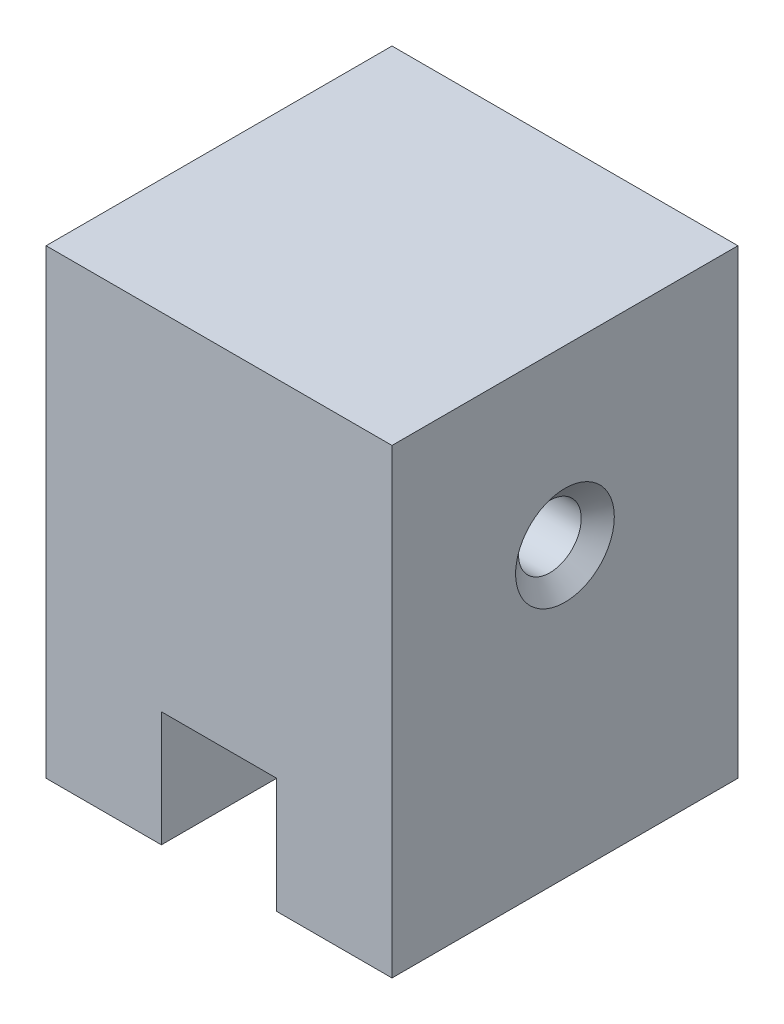
ISO-10303-21;
HEADER;
FILE_DESCRIPTION(('STEP AP214'),'2;1');
FILE_NAME('part.step','',(''),(''),'','','');
FILE_SCHEMA(('AUTOMOTIVE_DESIGN { 1 0 10303 214 1 1 1 1 }'));
ENDSEC;
DATA;
#1=APPLICATION_CONTEXT('core data for automotive mechanical design processes');
#2=APPLICATION_PROTOCOL_DEFINITION('international standard','automotive_design',2000,#1);
#3=PRODUCT_CONTEXT('',#1,'mechanical');
#4=PRODUCT('Part','Part','',(#3));
#5=PRODUCT_RELATED_PRODUCT_CATEGORY('part','',(#4));
#6=PRODUCT_DEFINITION_FORMATION('','',#4);
#7=PRODUCT_DEFINITION_CONTEXT('part definition',#1,'design');
#8=PRODUCT_DEFINITION('design','',#6,#7);
#9=PRODUCT_DEFINITION_SHAPE('','',#8);
#10=(LENGTH_UNIT() NAMED_UNIT(*) SI_UNIT(.MILLI.,.METRE.));
#11=(NAMED_UNIT(*) PLANE_ANGLE_UNIT() SI_UNIT($,.RADIAN.));
#12=(NAMED_UNIT(*) SI_UNIT($,.STERADIAN.) SOLID_ANGLE_UNIT());
#13=UNCERTAINTY_MEASURE_WITH_UNIT(LENGTH_MEASURE(1.E-05),#10,'distance_accuracy_value','');
#14=(GEOMETRIC_REPRESENTATION_CONTEXT(3) GLOBAL_UNCERTAINTY_ASSIGNED_CONTEXT((#13)) GLOBAL_UNIT_ASSIGNED_CONTEXT((#10,
#11,#12)) REPRESENTATION_CONTEXT('',''));
#15=CARTESIAN_POINT('',(0.,0.,0.));
#16=DIRECTION('',(0.,0.,1.));
#17=DIRECTION('',(1.,0.,0.));
#18=AXIS2_PLACEMENT_3D('',#15,#16,#17);
#19=CARTESIAN_POINT('',(0.,0.,0.));
#20=DIRECTION('',(0.,-1.,0.));
#21=DIRECTION('',(0.,0.,-1.));
#22=AXIS2_PLACEMENT_3D('',#19,#20,#21);
#23=PLANE('',#22);
#24=DIRECTION('',(0.,0.,1.));
#25=VECTOR('',#24,1.);
#26=CARTESIAN_POINT('',(-3.175,0.,-9.525));
#27=LINE('',#26,#25);
#28=CARTESIAN_POINT('',(-3.175,0.,-9.525));
#29=VERTEX_POINT('',#28);
#30=CARTESIAN_POINT('',(-3.175,0.,9.525));
#31=VERTEX_POINT('',#30);
#32=EDGE_CURVE('E121',#29,#31,#27,.T.);
#33=ORIENTED_EDGE('',*,*,#32,.T.);
#34=DIRECTION('',(1.,0.,0.));
#35=VECTOR('',#34,1.);
#36=CARTESIAN_POINT('',(-9.525,0.,9.525));
#37=LINE('',#36,#35);
#38=CARTESIAN_POINT('',(-9.525,0.,9.525));
#39=VERTEX_POINT('',#38);
#40=EDGE_CURVE('E153',#39,#31,#37,.T.);
#41=ORIENTED_EDGE('',*,*,#40,.F.);
#42=DIRECTION('',(0.,0.,1.));
#43=VECTOR('',#42,1.);
#44=CARTESIAN_POINT('',(-9.525,0.,9.525));
#45=LINE('',#44,#43);
#46=CARTESIAN_POINT('',(-9.525,0.,-9.525));
#47=VERTEX_POINT('',#46);
#48=EDGE_CURVE('E142',#47,#39,#45,.T.);
#49=ORIENTED_EDGE('',*,*,#48,.F.);
#50=DIRECTION('',(-1.,0.,0.));
#51=VECTOR('',#50,1.);
#52=CARTESIAN_POINT('',(-9.525,0.,-9.525));
#53=LINE('',#52,#51);
#54=EDGE_CURVE('E136',#29,#47,#53,.T.);
#55=ORIENTED_EDGE('',*,*,#54,.F.);
#56=EDGE_LOOP('',(#33,#41,#49,#55));
#57=FACE_BOUND('',#56,.T.);
#58=ADVANCED_FACE('F47',(#57),#23,.T.);
#59=CARTESIAN_POINT('',(9.525,25.4,9.525));
#60=DIRECTION('',(-1.,0.,0.));
#61=DIRECTION('',(0.,0.,1.));
#62=AXIS2_PLACEMENT_3D('',#59,#60,#61);
#63=PLANE('',#62);
#64=CARTESIAN_POINT('',(9.525,15.875,0.));
#65=DIRECTION('',(1.,0.,0.));
#66=DIRECTION('',(0.,0.,-1.));
#67=AXIS2_PLACEMENT_3D('',#64,#65,#66);
#68=CIRCLE('',#67,2.7178);
#69=CARTESIAN_POINT('',(9.525,15.875,-2.7178));
#70=VERTEX_POINT('',#69);
#71=EDGE_CURVE('E187',#70,#70,#68,.T.);
#72=ORIENTED_EDGE('',*,*,#71,.F.);
#73=EDGE_LOOP('',(#72));
#74=FACE_BOUND('',#73,.T.);
#75=DIRECTION('',(0.,0.,-1.));
#76=VECTOR('',#75,1.);
#77=CARTESIAN_POINT('',(9.525,0.,9.525));
#78=LINE('',#77,#76);
#79=CARTESIAN_POINT('',(9.525,0.,9.525));
#80=VERTEX_POINT('',#79);
#81=CARTESIAN_POINT('',(9.525,0.,-9.525));
#82=VERTEX_POINT('',#81);
#83=EDGE_CURVE('E144',#80,#82,#78,.T.);
#84=ORIENTED_EDGE('',*,*,#83,.T.);
#85=DIRECTION('',(0.,-1.,0.));
#86=VECTOR('',#85,1.);
#87=CARTESIAN_POINT('',(9.525,25.4,-9.525));
#88=LINE('',#87,#86);
#89=CARTESIAN_POINT('',(9.525,25.4,-9.525));
#90=VERTEX_POINT('',#89);
#91=EDGE_CURVE('E13',#90,#82,#88,.T.);
#92=ORIENTED_EDGE('',*,*,#91,.F.);
#93=DIRECTION('',(0.,0.,-1.));
#94=VECTOR('',#93,1.);
#95=CARTESIAN_POINT('',(9.525,25.4,9.525));
#96=LINE('',#95,#94);
#97=CARTESIAN_POINT('',(9.525,25.4,9.525));
#98=VERTEX_POINT('',#97);
#99=EDGE_CURVE('E155',#98,#90,#96,.T.);
#100=ORIENTED_EDGE('',*,*,#99,.F.);
#101=DIRECTION('',(0.,-1.,0.));
#102=VECTOR('',#101,1.);
#103=CARTESIAN_POINT('',(9.525,25.4,9.525));
#104=LINE('',#103,#102);
#105=EDGE_CURVE('E156',#98,#80,#104,.T.);
#106=ORIENTED_EDGE('',*,*,#105,.T.);
#107=EDGE_LOOP('',(#84,#92,#100,#106));
#108=FACE_BOUND('',#107,.T.);
#109=ADVANCED_FACE('F49',(#74,#108),#63,.F.);
#110=CARTESIAN_POINT('',(-9.525,25.4,-9.525));
#111=DIRECTION('',(0.,0.,1.));
#112=DIRECTION('',(1.,0.,0.));
#113=AXIS2_PLACEMENT_3D('',#110,#111,#112);
#114=PLANE('',#113);
#115=DIRECTION('',(-1.,0.,0.));
#116=VECTOR('',#115,1.);
#117=CARTESIAN_POINT('',(-3.175,6.35,-9.525));
#118=LINE('',#117,#116);
#119=CARTESIAN_POINT('',(3.175,6.35,-9.525));
#120=VERTEX_POINT('',#119);
#121=CARTESIAN_POINT('',(-3.175,6.35,-9.525));
#122=VERTEX_POINT('',#121);
#123=EDGE_CURVE('E133',#120,#122,#118,.T.);
#124=ORIENTED_EDGE('',*,*,#123,.T.);
#125=DIRECTION('',(0.,-1.,0.));
#126=VECTOR('',#125,1.);
#127=CARTESIAN_POINT('',(-3.175,0.,-9.525));
#128=LINE('',#127,#126);
#129=EDGE_CURVE('E124',#122,#29,#128,.T.);
#130=ORIENTED_EDGE('',*,*,#129,.T.);
#131=ORIENTED_EDGE('',*,*,#54,.T.);
#132=DIRECTION('',(0.,-1.,0.));
#133=VECTOR('',#132,1.);
#134=CARTESIAN_POINT('',(-9.525,25.4,-9.525));
#135=LINE('',#134,#133);
#136=CARTESIAN_POINT('',(-9.525,25.4,-9.525));
#137=VERTEX_POINT('',#136);
#138=EDGE_CURVE('E55',#137,#47,#135,.T.);
#139=ORIENTED_EDGE('',*,*,#138,.F.);
#140=DIRECTION('',(-1.,0.,0.));
#141=VECTOR('',#140,1.);
#142=CARTESIAN_POINT('',(-9.525,25.4,-9.525));
#143=LINE('',#142,#141);
#144=EDGE_CURVE('E99',#90,#137,#143,.T.);
#145=ORIENTED_EDGE('',*,*,#144,.F.);
#146=ORIENTED_EDGE('',*,*,#91,.T.);
#147=CARTESIAN_POINT('',(3.175,0.,-9.525));
#148=VERTEX_POINT('',#147);
#149=EDGE_CURVE('E143',#82,#148,#53,.T.);
#150=ORIENTED_EDGE('',*,*,#149,.T.);
#151=DIRECTION('',(0.,1.,0.));
#152=VECTOR('',#151,1.);
#153=CARTESIAN_POINT('',(3.175,0.,-9.525));
#154=LINE('',#153,#152);
#155=EDGE_CURVE('E62',#148,#120,#154,.T.);
#156=ORIENTED_EDGE('',*,*,#155,.T.);
#157=EDGE_LOOP('',(#124,#130,#131,#139,#145,#146,#150,#156));
#158=FACE_BOUND('',#157,.T.);
#159=ADVANCED_FACE('F135',(#158),#114,.F.);
#160=CARTESIAN_POINT('',(-9.525,25.4,9.525));
#161=DIRECTION('',(1.,0.,0.));
#162=DIRECTION('',(0.,0.,-1.));
#163=AXIS2_PLACEMENT_3D('',#160,#161,#162);
#164=PLANE('',#163);
#165=CARTESIAN_POINT('',(-9.525,15.875,0.));
#166=DIRECTION('',(1.,0.,0.));
#167=DIRECTION('',(0.,0.,-1.));
#168=AXIS2_PLACEMENT_3D('',#165,#166,#167);
#169=CIRCLE('',#168,1.7272);
#170=CARTESIAN_POINT('',(-9.525,15.875,-1.7272));
#171=VERTEX_POINT('',#170);
#172=EDGE_CURVE('E179',#171,#171,#169,.T.);
#173=ORIENTED_EDGE('',*,*,#172,.T.);
#174=EDGE_LOOP('',(#173));
#175=FACE_BOUND('',#174,.T.);
#176=ORIENTED_EDGE('',*,*,#48,.T.);
#177=DIRECTION('',(0.,-1.,0.));
#178=VECTOR('',#177,1.);
#179=CARTESIAN_POINT('',(-9.525,25.4,9.525));
#180=LINE('',#179,#178);
#181=CARTESIAN_POINT('',(-9.525,25.4,9.525));
#182=VERTEX_POINT('',#181);
#183=EDGE_CURVE('E158',#182,#39,#180,.T.);
#184=ORIENTED_EDGE('',*,*,#183,.F.);
#185=DIRECTION('',(0.,0.,1.));
#186=VECTOR('',#185,1.);
#187=CARTESIAN_POINT('',(-9.525,25.4,9.525));
#188=LINE('',#187,#186);
#189=EDGE_CURVE('E164',#137,#182,#188,.T.);
#190=ORIENTED_EDGE('',*,*,#189,.F.);
#191=ORIENTED_EDGE('',*,*,#138,.T.);
#192=EDGE_LOOP('',(#176,#184,#190,#191));
#193=FACE_BOUND('',#192,.T.);
#194=ADVANCED_FACE('F162',(#175,#193),#164,.F.);
#195=CARTESIAN_POINT('',(-9.525,25.4,9.525));
#196=DIRECTION('',(0.,0.,-1.));
#197=DIRECTION('',(-1.,0.,0.));
#198=AXIS2_PLACEMENT_3D('',#195,#196,#197);
#199=PLANE('',#198);
#200=ORIENTED_EDGE('',*,*,#40,.T.);
#201=DIRECTION('',(0.,-1.,0.));
#202=VECTOR('',#201,1.);
#203=CARTESIAN_POINT('',(-3.175,0.,9.525));
#204=LINE('',#203,#202);
#205=CARTESIAN_POINT('',(-3.175,6.35,9.525));
#206=VERTEX_POINT('',#205);
#207=EDGE_CURVE('E127',#206,#31,#204,.T.);
#208=ORIENTED_EDGE('',*,*,#207,.F.);
#209=DIRECTION('',(-1.,0.,0.));
#210=VECTOR('',#209,1.);
#211=CARTESIAN_POINT('',(-3.175,6.35,9.525));
#212=LINE('',#211,#210);
#213=CARTESIAN_POINT('',(3.175,6.35,9.525));
#214=VERTEX_POINT('',#213);
#215=EDGE_CURVE('E139',#214,#206,#212,.T.);
#216=ORIENTED_EDGE('',*,*,#215,.F.);
#217=DIRECTION('',(0.,1.,0.));
#218=VECTOR('',#217,1.);
#219=CARTESIAN_POINT('',(3.175,0.,9.525));
#220=LINE('',#219,#218);
#221=CARTESIAN_POINT('',(3.175,0.,9.525));
#222=VERTEX_POINT('',#221);
#223=EDGE_CURVE('E175',#222,#214,#220,.T.);
#224=ORIENTED_EDGE('',*,*,#223,.F.);
#225=EDGE_CURVE('E92',#222,#80,#37,.T.);
#226=ORIENTED_EDGE('',*,*,#225,.T.);
#227=ORIENTED_EDGE('',*,*,#105,.F.);
#228=DIRECTION('',(1.,0.,0.));
#229=VECTOR('',#228,1.);
#230=CARTESIAN_POINT('',(-9.525,25.4,9.525));
#231=LINE('',#230,#229);
#232=EDGE_CURVE('E71',#182,#98,#231,.T.);
#233=ORIENTED_EDGE('',*,*,#232,.F.);
#234=ORIENTED_EDGE('',*,*,#183,.T.);
#235=EDGE_LOOP('',(#200,#208,#216,#224,#226,#227,#233,#234));
#236=FACE_BOUND('',#235,.T.);
#237=ADVANCED_FACE('F202',(#236),#199,.F.);
#238=CARTESIAN_POINT('',(0.,25.4,0.));
#239=DIRECTION('',(0.,-1.,0.));
#240=DIRECTION('',(0.,0.,-1.));
#241=AXIS2_PLACEMENT_3D('',#238,#239,#240);
#242=PLANE('',#241);
#243=ORIENTED_EDGE('',*,*,#99,.T.);
#244=ORIENTED_EDGE('',*,*,#144,.T.);
#245=ORIENTED_EDGE('',*,*,#189,.T.);
#246=ORIENTED_EDGE('',*,*,#232,.T.);
#247=EDGE_LOOP('',(#243,#244,#245,#246));
#248=FACE_BOUND('',#247,.T.);
#249=ADVANCED_FACE('F222',(#248),#242,.F.);
#250=DIRECTION('',(0.,0.,1.));
#251=VECTOR('',#250,1.);
#252=CARTESIAN_POINT('',(3.175,0.,-9.525));
#253=LINE('',#252,#251);
#254=EDGE_CURVE('E132',#148,#222,#253,.T.);
#255=ORIENTED_EDGE('',*,*,#254,.F.);
#256=ORIENTED_EDGE('',*,*,#149,.F.);
#257=ORIENTED_EDGE('',*,*,#83,.F.);
#258=ORIENTED_EDGE('',*,*,#225,.F.);
#259=EDGE_LOOP('',(#255,#256,#257,#258));
#260=FACE_BOUND('',#259,.T.);
#261=ADVANCED_FACE('F199',(#260),#23,.T.);
#262=CARTESIAN_POINT('',(-3.175,0.,-9.525));
#263=DIRECTION('',(-1.,0.,0.));
#264=DIRECTION('',(0.,0.,1.));
#265=AXIS2_PLACEMENT_3D('',#262,#263,#264);
#266=PLANE('',#265);
#267=ORIENTED_EDGE('',*,*,#207,.T.);
#268=ORIENTED_EDGE('',*,*,#32,.F.);
#269=ORIENTED_EDGE('',*,*,#129,.F.);
#270=DIRECTION('',(0.,0.,1.));
#271=VECTOR('',#270,1.);
#272=CARTESIAN_POINT('',(-3.175,6.35,-9.525));
#273=LINE('',#272,#271);
#274=EDGE_CURVE('E148',#122,#206,#273,.T.);
#275=ORIENTED_EDGE('',*,*,#274,.T.);
#276=EDGE_LOOP('',(#267,#268,#269,#275));
#277=FACE_BOUND('',#276,.T.);
#278=ADVANCED_FACE('F123',(#277),#266,.F.);
#279=CARTESIAN_POINT('',(-3.175,6.35,-9.525));
#280=DIRECTION('',(0.,1.,0.));
#281=DIRECTION('',(0.,0.,1.));
#282=AXIS2_PLACEMENT_3D('',#279,#280,#281);
#283=PLANE('',#282);
#284=ORIENTED_EDGE('',*,*,#215,.T.);
#285=ORIENTED_EDGE('',*,*,#274,.F.);
#286=ORIENTED_EDGE('',*,*,#123,.F.);
#287=DIRECTION('',(0.,0.,1.));
#288=VECTOR('',#287,1.);
#289=CARTESIAN_POINT('',(3.175,6.35,-9.525));
#290=LINE('',#289,#288);
#291=EDGE_CURVE('E170',#120,#214,#290,.T.);
#292=ORIENTED_EDGE('',*,*,#291,.T.);
#293=EDGE_LOOP('',(#284,#285,#286,#292));
#294=FACE_BOUND('',#293,.T.);
#295=ADVANCED_FACE('F204',(#294),#283,.F.);
#296=CARTESIAN_POINT('',(3.175,0.,-9.525));
#297=DIRECTION('',(1.,0.,0.));
#298=DIRECTION('',(0.,0.,-1.));
#299=AXIS2_PLACEMENT_3D('',#296,#297,#298);
#300=PLANE('',#299);
#301=ORIENTED_EDGE('',*,*,#223,.T.);
#302=ORIENTED_EDGE('',*,*,#291,.F.);
#303=ORIENTED_EDGE('',*,*,#155,.F.);
#304=ORIENTED_EDGE('',*,*,#254,.T.);
#305=EDGE_LOOP('',(#301,#302,#303,#304));
#306=FACE_BOUND('',#305,.T.);
#307=ADVANCED_FACE('F200',(#306),#300,.F.);
#308=CARTESIAN_POINT('',(9.525,15.875,0.));
#309=DIRECTION('',(1.,0.,0.));
#310=DIRECTION('',(0.,0.,-1.));
#311=AXIS2_PLACEMENT_3D('',#308,#309,#310);
#312=CYLINDRICAL_SURFACE('',#311,1.72719999999999);
#313=ORIENTED_EDGE('',*,*,#172,.F.);
#314=EDGE_LOOP('',(#313));
#315=FACE_BOUND('',#314,.T.);
#316=CARTESIAN_POINT('',(8.69378790535576,15.875,0.));
#317=DIRECTION('',(1.,0.,0.));
#318=DIRECTION('',(0.,0.,-1.));
#319=AXIS2_PLACEMENT_3D('',#316,#317,#318);
#320=CIRCLE('',#319,1.72719999999999);
#321=CARTESIAN_POINT('',(8.69378790535576,15.875,-1.72719999999999));
#322=VERTEX_POINT('',#321);
#323=EDGE_CURVE('E184',#322,#322,#320,.T.);
#324=ORIENTED_EDGE('',*,*,#323,.T.);
#325=EDGE_LOOP('',(#324));
#326=FACE_BOUND('',#325,.T.);
#327=ADVANCED_FACE('F211',(#315,#326),#312,.F.);
#328=CARTESIAN_POINT('',(9.525,15.875,0.));
#329=DIRECTION('',(1.,0.,0.));
#330=DIRECTION('',(0.,0.,-1.));
#331=AXIS2_PLACEMENT_3D('',#328,#329,#330);
#332=CONICAL_SURFACE('',#331,2.7178,0.872664625997157);
#333=ORIENTED_EDGE('',*,*,#323,.F.);
#334=EDGE_LOOP('',(#333));
#335=FACE_BOUND('',#334,.T.);
#336=ORIENTED_EDGE('',*,*,#71,.T.);
#337=EDGE_LOOP('',(#336));
#338=FACE_BOUND('',#337,.T.);
#339=ADVANCED_FACE('F191',(#335,#338),#332,.F.);
#340=CLOSED_SHELL('',(#58,#109,#159,#194,#237,#249,#261,#278,#295,#307,#327,#339));
#341=MANIFOLD_SOLID_BREP('B2',#340);
#342=ADVANCED_BREP_SHAPE_REPRESENTATION('',(#18,#341),#14);
#343=SHAPE_DEFINITION_REPRESENTATION(#9,#342);
ENDSEC;
END-ISO-10303-21;
